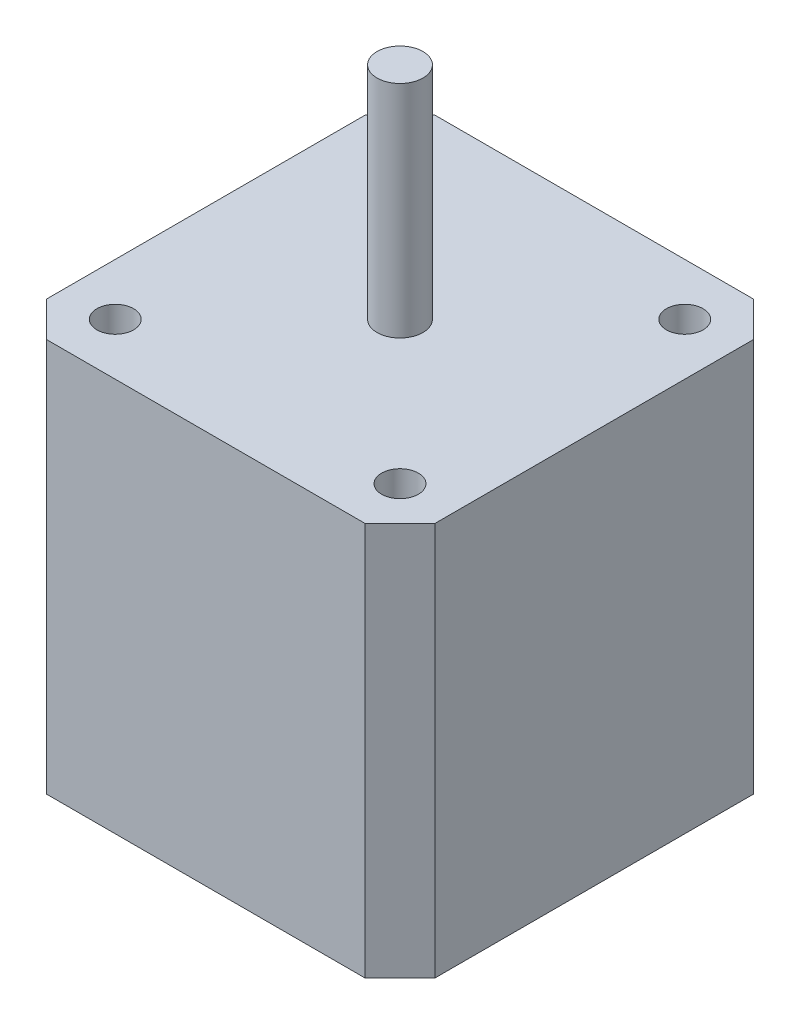
ISO-10303-21;
HEADER;
FILE_DESCRIPTION(('STEP AP214'),'2;1');
FILE_NAME('part.step','',(''),(''),'','','');
FILE_SCHEMA(('AUTOMOTIVE_DESIGN { 1 0 10303 214 1 1 1 1 }'));
ENDSEC;
DATA;
#1=APPLICATION_CONTEXT('core data for automotive mechanical design processes');
#2=APPLICATION_PROTOCOL_DEFINITION('international standard','automotive_design',2000,#1);
#3=PRODUCT_CONTEXT('',#1,'mechanical');
#4=PRODUCT('Part','Part','',(#3));
#5=PRODUCT_RELATED_PRODUCT_CATEGORY('part','',(#4));
#6=PRODUCT_DEFINITION_FORMATION('','',#4);
#7=PRODUCT_DEFINITION_CONTEXT('part definition',#1,'design');
#8=PRODUCT_DEFINITION('design','',#6,#7);
#9=PRODUCT_DEFINITION_SHAPE('','',#8);
#10=(LENGTH_UNIT() NAMED_UNIT(*) SI_UNIT(.MILLI.,.METRE.));
#11=(NAMED_UNIT(*) PLANE_ANGLE_UNIT() SI_UNIT($,.RADIAN.));
#12=(NAMED_UNIT(*) SI_UNIT($,.STERADIAN.) SOLID_ANGLE_UNIT());
#13=UNCERTAINTY_MEASURE_WITH_UNIT(LENGTH_MEASURE(1.E-05),#10,'distance_accuracy_value','');
#14=(GEOMETRIC_REPRESENTATION_CONTEXT(3) GLOBAL_UNCERTAINTY_ASSIGNED_CONTEXT((#13)) GLOBAL_UNIT_ASSIGNED_CONTEXT((#10,
#11,#12)) REPRESENTATION_CONTEXT('',''));
#15=CARTESIAN_POINT('',(0.,0.,0.));
#16=DIRECTION('',(0.,0.,1.));
#17=DIRECTION('',(1.,0.,0.));
#18=AXIS2_PLACEMENT_3D('',#15,#16,#17);
#19=CARTESIAN_POINT('',(-21.149999991,42.8625,21.149999991));
#20=DIRECTION('',(1.,0.,0.));
#21=DIRECTION('',(0.,0.,-1.));
#22=AXIS2_PLACEMENT_3D('',#19,#20,#21);
#23=PLANE('',#22);
#24=DIRECTION('',(0.,0.,1.));
#25=VECTOR('',#24,1.);
#26=CARTESIAN_POINT('',(-21.149999991,0.,21.149999991));
#27=LINE('',#26,#25);
#28=CARTESIAN_POINT('',(-21.149999991,0.,-17.339999991));
#29=VERTEX_POINT('',#28);
#30=CARTESIAN_POINT('',(-21.149999991,0.,17.339999991));
#31=VERTEX_POINT('',#30);
#32=EDGE_CURVE('E126',#29,#31,#27,.T.);
#33=ORIENTED_EDGE('',*,*,#32,.T.);
#34=DIRECTION('',(0.,1.,0.));
#35=VECTOR('',#34,1.);
#36=CARTESIAN_POINT('',(-21.149999991,42.8625,17.339999991));
#37=LINE('',#36,#35);
#38=CARTESIAN_POINT('',(-21.149999991,42.8625,17.339999991));
#39=VERTEX_POINT('',#38);
#40=EDGE_CURVE('E104',#31,#39,#37,.T.);
#41=ORIENTED_EDGE('',*,*,#40,.T.);
#42=DIRECTION('',(0.,0.,1.));
#43=VECTOR('',#42,1.);
#44=CARTESIAN_POINT('',(-21.149999991,42.8625,21.149999991));
#45=LINE('',#44,#43);
#46=CARTESIAN_POINT('',(-21.149999991,42.8625,-17.339999991));
#47=VERTEX_POINT('',#46);
#48=EDGE_CURVE('E136',#47,#39,#45,.T.);
#49=ORIENTED_EDGE('',*,*,#48,.F.);
#50=DIRECTION('',(0.,-1.,0.));
#51=VECTOR('',#50,1.);
#52=CARTESIAN_POINT('',(-21.149999991,42.8625,-17.339999991));
#53=LINE('',#52,#51);
#54=EDGE_CURVE('E109',#47,#29,#53,.T.);
#55=ORIENTED_EDGE('',*,*,#54,.T.);
#56=EDGE_LOOP('',(#33,#41,#49,#55));
#57=FACE_BOUND('',#56,.T.);
#58=ADVANCED_FACE('F33',(#57),#23,.F.);
#59=CARTESIAN_POINT('',(21.149999991,42.8625,21.149999991));
#60=DIRECTION('',(0.,0.,-1.));
#61=DIRECTION('',(-1.,0.,0.));
#62=AXIS2_PLACEMENT_3D('',#59,#60,#61);
#63=PLANE('',#62);
#64=DIRECTION('',(1.,0.,0.));
#65=VECTOR('',#64,1.);
#66=CARTESIAN_POINT('',(21.149999991,42.8625,21.149999991));
#67=LINE('',#66,#65);
#68=CARTESIAN_POINT('',(-17.339999991,42.8625,21.149999991));
#69=VERTEX_POINT('',#68);
#70=CARTESIAN_POINT('',(17.339999991,42.8625,21.149999991));
#71=VERTEX_POINT('',#70);
#72=EDGE_CURVE('E119',#69,#71,#67,.T.);
#73=ORIENTED_EDGE('',*,*,#72,.F.);
#74=DIRECTION('',(0.,-1.,0.));
#75=VECTOR('',#74,1.);
#76=CARTESIAN_POINT('',(-17.339999991,42.8625,21.149999991));
#77=LINE('',#76,#75);
#78=CARTESIAN_POINT('',(-17.339999991,0.,21.149999991));
#79=VERTEX_POINT('',#78);
#80=EDGE_CURVE('E103',#69,#79,#77,.T.);
#81=ORIENTED_EDGE('',*,*,#80,.T.);
#82=DIRECTION('',(1.,0.,0.));
#83=VECTOR('',#82,1.);
#84=CARTESIAN_POINT('',(21.149999991,0.,21.149999991));
#85=LINE('',#84,#83);
#86=CARTESIAN_POINT('',(17.339999991,0.,21.149999991));
#87=VERTEX_POINT('',#86);
#88=EDGE_CURVE('E116',#79,#87,#85,.T.);
#89=ORIENTED_EDGE('',*,*,#88,.T.);
#90=DIRECTION('',(0.,1.,0.));
#91=VECTOR('',#90,1.);
#92=CARTESIAN_POINT('',(17.339999991,42.8625,21.149999991));
#93=LINE('',#92,#91);
#94=EDGE_CURVE('E121',#87,#71,#93,.T.);
#95=ORIENTED_EDGE('',*,*,#94,.T.);
#96=EDGE_LOOP('',(#73,#81,#89,#95));
#97=FACE_BOUND('',#96,.T.);
#98=ADVANCED_FACE('F115',(#97),#63,.F.);
#99=CARTESIAN_POINT('',(21.149999991,42.8625,21.149999991));
#100=DIRECTION('',(-1.,0.,0.));
#101=DIRECTION('',(0.,0.,1.));
#102=AXIS2_PLACEMENT_3D('',#99,#100,#101);
#103=PLANE('',#102);
#104=DIRECTION('',(0.,0.,-1.));
#105=VECTOR('',#104,1.);
#106=CARTESIAN_POINT('',(21.149999991,42.8625,21.149999991));
#107=LINE('',#106,#105);
#108=CARTESIAN_POINT('',(21.149999991,42.8625,17.339999991));
#109=VERTEX_POINT('',#108);
#110=CARTESIAN_POINT('',(21.149999991,42.8625,-17.339999991));
#111=VERTEX_POINT('',#110);
#112=EDGE_CURVE('E162',#109,#111,#107,.T.);
#113=ORIENTED_EDGE('',*,*,#112,.F.);
#114=DIRECTION('',(0.,-1.,0.));
#115=VECTOR('',#114,1.);
#116=CARTESIAN_POINT('',(21.149999991,42.8625,17.339999991));
#117=LINE('',#116,#115);
#118=CARTESIAN_POINT('',(21.149999991,0.,17.339999991));
#119=VERTEX_POINT('',#118);
#120=EDGE_CURVE('E155',#109,#119,#117,.T.);
#121=ORIENTED_EDGE('',*,*,#120,.T.);
#122=DIRECTION('',(0.,0.,-1.));
#123=VECTOR('',#122,1.);
#124=CARTESIAN_POINT('',(21.149999991,0.,21.149999991));
#125=LINE('',#124,#123);
#126=CARTESIAN_POINT('',(21.149999991,0.,-17.339999991));
#127=VERTEX_POINT('',#126);
#128=EDGE_CURVE('E125',#119,#127,#125,.T.);
#129=ORIENTED_EDGE('',*,*,#128,.T.);
#130=DIRECTION('',(0.,1.,0.));
#131=VECTOR('',#130,1.);
#132=CARTESIAN_POINT('',(21.149999991,42.8625,-17.339999991));
#133=LINE('',#132,#131);
#134=EDGE_CURVE('E153',#127,#111,#133,.T.);
#135=ORIENTED_EDGE('',*,*,#134,.T.);
#136=EDGE_LOOP('',(#113,#121,#129,#135));
#137=FACE_BOUND('',#136,.T.);
#138=ADVANCED_FACE('F160',(#137),#103,.F.);
#139=CARTESIAN_POINT('',(21.149999991,42.8625,-21.149999991));
#140=DIRECTION('',(0.,0.,1.));
#141=DIRECTION('',(1.,0.,0.));
#142=AXIS2_PLACEMENT_3D('',#139,#140,#141);
#143=PLANE('',#142);
#144=DIRECTION('',(-1.,0.,0.));
#145=VECTOR('',#144,1.);
#146=CARTESIAN_POINT('',(21.149999991,42.8625,-21.149999991));
#147=LINE('',#146,#145);
#148=CARTESIAN_POINT('',(17.339999991,42.8625,-21.149999991));
#149=VERTEX_POINT('',#148);
#150=CARTESIAN_POINT('',(-17.339999991,42.8625,-21.149999991));
#151=VERTEX_POINT('',#150);
#152=EDGE_CURVE('E137',#149,#151,#147,.T.);
#153=ORIENTED_EDGE('',*,*,#152,.F.);
#154=DIRECTION('',(0.,-1.,0.));
#155=VECTOR('',#154,1.);
#156=CARTESIAN_POINT('',(17.339999991,42.8625,-21.149999991));
#157=LINE('',#156,#155);
#158=CARTESIAN_POINT('',(17.339999991,0.,-21.149999991));
#159=VERTEX_POINT('',#158);
#160=EDGE_CURVE('E11',#149,#159,#157,.T.);
#161=ORIENTED_EDGE('',*,*,#160,.T.);
#162=DIRECTION('',(-1.,0.,0.));
#163=VECTOR('',#162,1.);
#164=CARTESIAN_POINT('',(21.149999991,0.,-21.149999991));
#165=LINE('',#164,#163);
#166=CARTESIAN_POINT('',(-17.339999991,0.,-21.149999991));
#167=VERTEX_POINT('',#166);
#168=EDGE_CURVE('E129',#159,#167,#165,.T.);
#169=ORIENTED_EDGE('',*,*,#168,.T.);
#170=DIRECTION('',(0.,1.,0.));
#171=VECTOR('',#170,1.);
#172=CARTESIAN_POINT('',(-17.339999991,42.8625,-21.149999991));
#173=LINE('',#172,#171);
#174=EDGE_CURVE('E41',#167,#151,#173,.T.);
#175=ORIENTED_EDGE('',*,*,#174,.T.);
#176=EDGE_LOOP('',(#153,#161,#169,#175));
#177=FACE_BOUND('',#176,.T.);
#178=ADVANCED_FACE('F169',(#177),#143,.F.);
#179=CARTESIAN_POINT('',(0.,42.8625,0.));
#180=DIRECTION('',(0.,1.,0.));
#181=DIRECTION('',(0.,0.,1.));
#182=AXIS2_PLACEMENT_3D('',#179,#180,#181);
#183=PLANE('',#182);
#184=CARTESIAN_POINT('',(0.,42.8625,0.));
#185=DIRECTION('',(0.,1.,0.));
#186=DIRECTION('',(0.,0.,1.));
#187=AXIS2_PLACEMENT_3D('',#184,#185,#186);
#188=CIRCLE('',#187,2.5);
#189=CARTESIAN_POINT('',(0.,42.8625,2.5));
#190=VERTEX_POINT('',#189);
#191=EDGE_CURVE('E200',#190,#190,#188,.T.);
#192=ORIENTED_EDGE('',*,*,#191,.F.);
#193=EDGE_LOOP('',(#192));
#194=FACE_BOUND('',#193,.T.);
#195=CARTESIAN_POINT('',(15.499999988,42.8625,15.499999988));
#196=DIRECTION('',(0.,1.,0.));
#197=DIRECTION('',(0.,0.,1.));
#198=AXIS2_PLACEMENT_3D('',#195,#196,#197);
#199=CIRCLE('',#198,2.);
#200=CARTESIAN_POINT('',(15.499999988,42.8625,17.499999988));
#201=VERTEX_POINT('',#200);
#202=EDGE_CURVE('E194',#201,#201,#199,.T.);
#203=ORIENTED_EDGE('',*,*,#202,.F.);
#204=EDGE_LOOP('',(#203));
#205=FACE_BOUND('',#204,.T.);
#206=CARTESIAN_POINT('',(15.499999988,42.8625,-15.499999988));
#207=DIRECTION('',(0.,1.,0.));
#208=DIRECTION('',(0.,0.,1.));
#209=AXIS2_PLACEMENT_3D('',#206,#207,#208);
#210=CIRCLE('',#209,2.00000000000001);
#211=CARTESIAN_POINT('',(15.499999988,42.8625,-13.499999988));
#212=VERTEX_POINT('',#211);
#213=EDGE_CURVE('E188',#212,#212,#210,.T.);
#214=ORIENTED_EDGE('',*,*,#213,.F.);
#215=EDGE_LOOP('',(#214));
#216=FACE_BOUND('',#215,.T.);
#217=CARTESIAN_POINT('',(-15.499999988,42.8625,15.499999988));
#218=DIRECTION('',(0.,1.,0.));
#219=DIRECTION('',(0.,0.,1.));
#220=AXIS2_PLACEMENT_3D('',#217,#218,#219);
#221=CIRCLE('',#220,2.);
#222=CARTESIAN_POINT('',(-15.499999988,42.8625,17.499999988));
#223=VERTEX_POINT('',#222);
#224=EDGE_CURVE('E182',#223,#223,#221,.T.);
#225=ORIENTED_EDGE('',*,*,#224,.F.);
#226=EDGE_LOOP('',(#225));
#227=FACE_BOUND('',#226,.T.);
#228=CARTESIAN_POINT('',(-15.499999988,42.8625,-15.499999988));
#229=DIRECTION('',(0.,1.,0.));
#230=DIRECTION('',(0.,0.,1.));
#231=AXIS2_PLACEMENT_3D('',#228,#229,#230);
#232=CIRCLE('',#231,2.);
#233=CARTESIAN_POINT('',(-15.499999988,42.8625,-13.499999988));
#234=VERTEX_POINT('',#233);
#235=EDGE_CURVE('E176',#234,#234,#232,.T.);
#236=ORIENTED_EDGE('',*,*,#235,.F.);
#237=EDGE_LOOP('',(#236));
#238=FACE_BOUND('',#237,.T.);
#239=ORIENTED_EDGE('',*,*,#48,.T.);
#240=DIRECTION('',(-0.707106781186546,0.,-0.707106781186549));
#241=VECTOR('',#240,1.);
#242=CARTESIAN_POINT('',(-19.244999991,42.8625,19.244999991));
#243=LINE('',#242,#241);
#244=EDGE_CURVE('E151',#39,#69,#243,.F.);
#245=ORIENTED_EDGE('',*,*,#244,.T.);
#246=ORIENTED_EDGE('',*,*,#72,.T.);
#247=DIRECTION('',(-0.707106781186549,0.,0.707106781186546));
#248=VECTOR('',#247,1.);
#249=CARTESIAN_POINT('',(19.2449999909999,42.8625,19.244999991));
#250=LINE('',#249,#248);
#251=EDGE_CURVE('E149',#71,#109,#250,.F.);
#252=ORIENTED_EDGE('',*,*,#251,.T.);
#253=ORIENTED_EDGE('',*,*,#112,.T.);
#254=DIRECTION('',(0.707106781186546,0.,0.707106781186549));
#255=VECTOR('',#254,1.);
#256=CARTESIAN_POINT('',(19.244999991,42.8625,-19.2449999909999));
#257=LINE('',#256,#255);
#258=EDGE_CURVE('E54',#111,#149,#257,.F.);
#259=ORIENTED_EDGE('',*,*,#258,.T.);
#260=ORIENTED_EDGE('',*,*,#152,.T.);
#261=DIRECTION('',(0.70710678118655,0.,-0.707106781186545));
#262=VECTOR('',#261,1.);
#263=CARTESIAN_POINT('',(-19.2449999909999,42.8625,-19.2449999910001));
#264=LINE('',#263,#262);
#265=EDGE_CURVE('E146',#151,#47,#264,.F.);
#266=ORIENTED_EDGE('',*,*,#265,.T.);
#267=EDGE_LOOP('',(#239,#245,#246,#252,#253,#259,#260,#266));
#268=FACE_BOUND('',#267,.T.);
#269=ADVANCED_FACE('F214',(#194,#205,#216,#227,#238,#268),#183,.T.);
#270=CARTESIAN_POINT('',(0.,0.,0.));
#271=DIRECTION('',(0.,1.,0.));
#272=DIRECTION('',(0.,0.,1.));
#273=AXIS2_PLACEMENT_3D('',#270,#271,#272);
#274=PLANE('',#273);
#275=ORIENTED_EDGE('',*,*,#88,.F.);
#276=DIRECTION('',(0.707106781186546,0.,0.707106781186549));
#277=VECTOR('',#276,1.);
#278=CARTESIAN_POINT('',(-17.339999991,0.,21.149999991));
#279=LINE('',#278,#277);
#280=EDGE_CURVE('E99',#79,#31,#279,.F.);
#281=ORIENTED_EDGE('',*,*,#280,.T.);
#282=ORIENTED_EDGE('',*,*,#32,.F.);
#283=DIRECTION('',(-0.70710678118655,0.,0.707106781186545));
#284=VECTOR('',#283,1.);
#285=CARTESIAN_POINT('',(-21.149999991,0.,-17.339999991));
#286=LINE('',#285,#284);
#287=EDGE_CURVE('E120',#29,#167,#286,.F.);
#288=ORIENTED_EDGE('',*,*,#287,.T.);
#289=ORIENTED_EDGE('',*,*,#168,.F.);
#290=DIRECTION('',(-0.707106781186546,0.,-0.707106781186549));
#291=VECTOR('',#290,1.);
#292=CARTESIAN_POINT('',(17.339999991,0.,-21.149999991));
#293=LINE('',#292,#291);
#294=EDGE_CURVE('E140',#159,#127,#293,.F.);
#295=ORIENTED_EDGE('',*,*,#294,.T.);
#296=ORIENTED_EDGE('',*,*,#128,.F.);
#297=DIRECTION('',(0.707106781186549,0.,-0.707106781186546));
#298=VECTOR('',#297,1.);
#299=CARTESIAN_POINT('',(21.149999991,0.,17.339999991));
#300=LINE('',#299,#298);
#301=EDGE_CURVE('E110',#119,#87,#300,.F.);
#302=ORIENTED_EDGE('',*,*,#301,.T.);
#303=EDGE_LOOP('',(#275,#281,#282,#288,#289,#295,#296,#302));
#304=FACE_BOUND('',#303,.T.);
#305=ADVANCED_FACE('F123',(#304),#274,.F.);
#306=CARTESIAN_POINT('',(-15.499999988,36.5125,-15.499999988));
#307=DIRECTION('',(0.,1.,0.));
#308=DIRECTION('',(0.,0.,1.));
#309=AXIS2_PLACEMENT_3D('',#306,#307,#308);
#310=CYLINDRICAL_SURFACE('',#309,2.);
#311=CARTESIAN_POINT('',(-15.499999988,36.5125,-15.499999988));
#312=DIRECTION('',(0.,1.,0.));
#313=DIRECTION('',(0.,0.,1.));
#314=AXIS2_PLACEMENT_3D('',#311,#312,#313);
#315=CIRCLE('',#314,2.);
#316=CARTESIAN_POINT('',(-15.499999988,36.5125,-13.499999988));
#317=VERTEX_POINT('',#316);
#318=EDGE_CURVE('E131',#317,#317,#315,.T.);
#319=ORIENTED_EDGE('',*,*,#318,.F.);
#320=EDGE_LOOP('',(#319));
#321=FACE_BOUND('',#320,.T.);
#322=ORIENTED_EDGE('',*,*,#235,.T.);
#323=EDGE_LOOP('',(#322));
#324=FACE_BOUND('',#323,.T.);
#325=ADVANCED_FACE('F313',(#321,#324),#310,.F.);
#326=CARTESIAN_POINT('',(-15.499999988,36.5125,-15.499999988));
#327=DIRECTION('',(0.,1.,0.));
#328=DIRECTION('',(0.,0.,1.));
#329=AXIS2_PLACEMENT_3D('',#326,#327,#328);
#330=PLANE('',#329);
#331=ORIENTED_EDGE('',*,*,#318,.T.);
#332=EDGE_LOOP('',(#331));
#333=FACE_BOUND('',#332,.T.);
#334=ADVANCED_FACE('F309',(#333),#330,.T.);
#335=CARTESIAN_POINT('',(-15.499999988,36.5125,15.499999988));
#336=DIRECTION('',(0.,1.,0.));
#337=DIRECTION('',(0.,0.,1.));
#338=AXIS2_PLACEMENT_3D('',#335,#336,#337);
#339=CYLINDRICAL_SURFACE('',#338,2.);
#340=CARTESIAN_POINT('',(-15.499999988,36.5125,15.499999988));
#341=DIRECTION('',(0.,1.,0.));
#342=DIRECTION('',(0.,0.,1.));
#343=AXIS2_PLACEMENT_3D('',#340,#341,#342);
#344=CIRCLE('',#343,2.);
#345=CARTESIAN_POINT('',(-15.499999988,36.5125,17.499999988));
#346=VERTEX_POINT('',#345);
#347=EDGE_CURVE('E179',#346,#346,#344,.T.);
#348=ORIENTED_EDGE('',*,*,#347,.F.);
#349=EDGE_LOOP('',(#348));
#350=FACE_BOUND('',#349,.T.);
#351=ORIENTED_EDGE('',*,*,#224,.T.);
#352=EDGE_LOOP('',(#351));
#353=FACE_BOUND('',#352,.T.);
#354=ADVANCED_FACE('F305',(#350,#353),#339,.F.);
#355=CARTESIAN_POINT('',(-15.499999988,36.5125,15.499999988));
#356=DIRECTION('',(0.,1.,0.));
#357=DIRECTION('',(0.,0.,1.));
#358=AXIS2_PLACEMENT_3D('',#355,#356,#357);
#359=PLANE('',#358);
#360=ORIENTED_EDGE('',*,*,#347,.T.);
#361=EDGE_LOOP('',(#360));
#362=FACE_BOUND('',#361,.T.);
#363=ADVANCED_FACE('F301',(#362),#359,.T.);
#364=CARTESIAN_POINT('',(15.499999988,36.5125,-15.499999988));
#365=DIRECTION('',(0.,1.,0.));
#366=DIRECTION('',(0.,0.,1.));
#367=AXIS2_PLACEMENT_3D('',#364,#365,#366);
#368=CYLINDRICAL_SURFACE('',#367,2.00000000000001);
#369=CARTESIAN_POINT('',(15.499999988,36.5125,-15.499999988));
#370=DIRECTION('',(0.,1.,0.));
#371=DIRECTION('',(0.,0.,1.));
#372=AXIS2_PLACEMENT_3D('',#369,#370,#371);
#373=CIRCLE('',#372,2.00000000000001);
#374=CARTESIAN_POINT('',(15.499999988,36.5125,-13.499999988));
#375=VERTEX_POINT('',#374);
#376=EDGE_CURVE('E185',#375,#375,#373,.T.);
#377=ORIENTED_EDGE('',*,*,#376,.F.);
#378=EDGE_LOOP('',(#377));
#379=FACE_BOUND('',#378,.T.);
#380=ORIENTED_EDGE('',*,*,#213,.T.);
#381=EDGE_LOOP('',(#380));
#382=FACE_BOUND('',#381,.T.);
#383=ADVANCED_FACE('F297',(#379,#382),#368,.F.);
#384=CARTESIAN_POINT('',(15.499999988,36.5125,-15.499999988));
#385=DIRECTION('',(0.,1.,0.));
#386=DIRECTION('',(0.,0.,1.));
#387=AXIS2_PLACEMENT_3D('',#384,#385,#386);
#388=PLANE('',#387);
#389=ORIENTED_EDGE('',*,*,#376,.T.);
#390=EDGE_LOOP('',(#389));
#391=FACE_BOUND('',#390,.T.);
#392=ADVANCED_FACE('F293',(#391),#388,.T.);
#393=CARTESIAN_POINT('',(15.499999988,36.5125,15.499999988));
#394=DIRECTION('',(0.,1.,0.));
#395=DIRECTION('',(0.,0.,1.));
#396=AXIS2_PLACEMENT_3D('',#393,#394,#395);
#397=CYLINDRICAL_SURFACE('',#396,2.);
#398=CARTESIAN_POINT('',(15.499999988,36.5125,15.499999988));
#399=DIRECTION('',(0.,1.,0.));
#400=DIRECTION('',(0.,0.,1.));
#401=AXIS2_PLACEMENT_3D('',#398,#399,#400);
#402=CIRCLE('',#401,2.);
#403=CARTESIAN_POINT('',(15.499999988,36.5125,17.499999988));
#404=VERTEX_POINT('',#403);
#405=EDGE_CURVE('E191',#404,#404,#402,.T.);
#406=ORIENTED_EDGE('',*,*,#405,.F.);
#407=EDGE_LOOP('',(#406));
#408=FACE_BOUND('',#407,.T.);
#409=ORIENTED_EDGE('',*,*,#202,.T.);
#410=EDGE_LOOP('',(#409));
#411=FACE_BOUND('',#410,.T.);
#412=ADVANCED_FACE('F289',(#408,#411),#397,.F.);
#413=CARTESIAN_POINT('',(15.499999988,36.5125,15.499999988));
#414=DIRECTION('',(0.,1.,0.));
#415=DIRECTION('',(0.,0.,1.));
#416=AXIS2_PLACEMENT_3D('',#413,#414,#415);
#417=PLANE('',#416);
#418=ORIENTED_EDGE('',*,*,#405,.T.);
#419=EDGE_LOOP('',(#418));
#420=FACE_BOUND('',#419,.T.);
#421=ADVANCED_FACE('F244',(#420),#417,.T.);
#422=CARTESIAN_POINT('',(-17.339999991,42.8625,21.149999991));
#423=DIRECTION('',(0.707106781186549,0.,-0.707106781186546));
#424=DIRECTION('',(0.,-1.,0.));
#425=AXIS2_PLACEMENT_3D('',#422,#423,#424);
#426=PLANE('',#425);
#427=ORIENTED_EDGE('',*,*,#244,.F.);
#428=ORIENTED_EDGE('',*,*,#40,.F.);
#429=ORIENTED_EDGE('',*,*,#280,.F.);
#430=ORIENTED_EDGE('',*,*,#80,.F.);
#431=EDGE_LOOP('',(#427,#428,#429,#430));
#432=FACE_BOUND('',#431,.T.);
#433=ADVANCED_FACE('F102',(#432),#426,.F.);
#434=CARTESIAN_POINT('',(21.149999991,42.8625,17.339999991));
#435=DIRECTION('',(-0.707106781186545,0.,-0.707106781186549));
#436=DIRECTION('',(0.,-1.,0.));
#437=AXIS2_PLACEMENT_3D('',#434,#435,#436);
#438=PLANE('',#437);
#439=ORIENTED_EDGE('',*,*,#251,.F.);
#440=ORIENTED_EDGE('',*,*,#94,.F.);
#441=ORIENTED_EDGE('',*,*,#301,.F.);
#442=ORIENTED_EDGE('',*,*,#120,.F.);
#443=EDGE_LOOP('',(#439,#440,#441,#442));
#444=FACE_BOUND('',#443,.T.);
#445=ADVANCED_FACE('F233',(#444),#438,.F.);
#446=CARTESIAN_POINT('',(17.339999991,42.8625,-21.149999991));
#447=DIRECTION('',(-0.707106781186549,0.,0.707106781186545));
#448=DIRECTION('',(0.,-1.,0.));
#449=AXIS2_PLACEMENT_3D('',#446,#447,#448);
#450=PLANE('',#449);
#451=ORIENTED_EDGE('',*,*,#258,.F.);
#452=ORIENTED_EDGE('',*,*,#134,.F.);
#453=ORIENTED_EDGE('',*,*,#294,.F.);
#454=ORIENTED_EDGE('',*,*,#160,.F.);
#455=EDGE_LOOP('',(#451,#452,#453,#454));
#456=FACE_BOUND('',#455,.T.);
#457=ADVANCED_FACE('F168',(#456),#450,.F.);
#458=CARTESIAN_POINT('',(-21.149999991,42.8625,-17.339999991));
#459=DIRECTION('',(0.707106781186545,0.,0.70710678118655));
#460=DIRECTION('',(0.,-1.,0.));
#461=AXIS2_PLACEMENT_3D('',#458,#459,#460);
#462=PLANE('',#461);
#463=ORIENTED_EDGE('',*,*,#265,.F.);
#464=ORIENTED_EDGE('',*,*,#174,.F.);
#465=ORIENTED_EDGE('',*,*,#287,.F.);
#466=ORIENTED_EDGE('',*,*,#54,.F.);
#467=EDGE_LOOP('',(#463,#464,#465,#466));
#468=FACE_BOUND('',#467,.T.);
#469=ADVANCED_FACE('F35',(#468),#462,.F.);
#470=CARTESIAN_POINT('',(0.,66.8625,0.));
#471=DIRECTION('',(0.,-1.,0.));
#472=DIRECTION('',(0.,0.,-1.));
#473=AXIS2_PLACEMENT_3D('',#470,#471,#472);
#474=CYLINDRICAL_SURFACE('',#473,2.5);
#475=CARTESIAN_POINT('',(0.,66.8625,0.));
#476=DIRECTION('',(0.,1.,0.));
#477=DIRECTION('',(0.,0.,1.));
#478=AXIS2_PLACEMENT_3D('',#475,#476,#477);
#479=CIRCLE('',#478,2.5);
#480=CARTESIAN_POINT('',(0.,66.8625,2.5));
#481=VERTEX_POINT('',#480);
#482=EDGE_CURVE('E197',#481,#481,#479,.T.);
#483=ORIENTED_EDGE('',*,*,#482,.F.);
#484=EDGE_LOOP('',(#483));
#485=FACE_BOUND('',#484,.T.);
#486=ORIENTED_EDGE('',*,*,#191,.T.);
#487=EDGE_LOOP('',(#486));
#488=FACE_BOUND('',#487,.T.);
#489=ADVANCED_FACE('F208',(#485,#488),#474,.T.);
#490=CARTESIAN_POINT('',(0.,66.8625,0.));
#491=DIRECTION('',(0.,1.,0.));
#492=DIRECTION('',(0.,0.,1.));
#493=AXIS2_PLACEMENT_3D('',#490,#491,#492);
#494=PLANE('',#493);
#495=ORIENTED_EDGE('',*,*,#482,.T.);
#496=EDGE_LOOP('',(#495));
#497=FACE_BOUND('',#496,.T.);
#498=ADVANCED_FACE('F206',(#497),#494,.T.);
#499=CLOSED_SHELL('',(#58,#98,#138,#178,#269,#305,#325,#334,#354,#363,#383,#392,#412,#421,#433,
#445,#457,#469,#489,#498));
#500=MANIFOLD_SOLID_BREP('B2',#499);
#501=ADVANCED_BREP_SHAPE_REPRESENTATION('',(#18,#500),#14);
#502=SHAPE_DEFINITION_REPRESENTATION(#9,#501);
ENDSEC;
END-ISO-10303-21;
